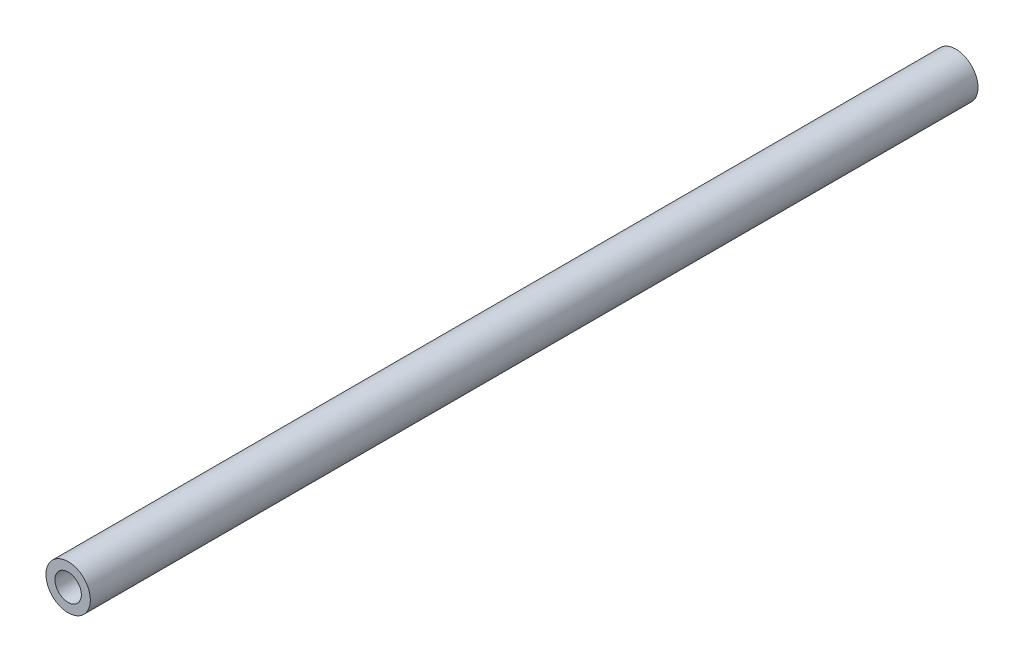
ISO-10303-21;
HEADER;
FILE_DESCRIPTION(('STEP AP214'),'2;1');
FILE_NAME('part.step','',(''),(''),'','','');
FILE_SCHEMA(('AUTOMOTIVE_DESIGN { 1 0 10303 214 1 1 1 1 }'));
ENDSEC;
DATA;
#1=APPLICATION_CONTEXT('core data for automotive mechanical design processes');
#2=APPLICATION_PROTOCOL_DEFINITION('international standard','automotive_design',2000,#1);
#3=PRODUCT_CONTEXT('',#1,'mechanical');
#4=PRODUCT('Part','Part','',(#3));
#5=PRODUCT_RELATED_PRODUCT_CATEGORY('part','',(#4));
#6=PRODUCT_DEFINITION_FORMATION('','',#4);
#7=PRODUCT_DEFINITION_CONTEXT('part definition',#1,'design');
#8=PRODUCT_DEFINITION('design','',#6,#7);
#9=PRODUCT_DEFINITION_SHAPE('','',#8);
#10=(LENGTH_UNIT() NAMED_UNIT(*) SI_UNIT(.MILLI.,.METRE.));
#11=(NAMED_UNIT(*) PLANE_ANGLE_UNIT() SI_UNIT($,.RADIAN.));
#12=(NAMED_UNIT(*) SI_UNIT($,.STERADIAN.) SOLID_ANGLE_UNIT());
#13=UNCERTAINTY_MEASURE_WITH_UNIT(LENGTH_MEASURE(1.E-05),#10,'distance_accuracy_value','');
#14=(GEOMETRIC_REPRESENTATION_CONTEXT(3) GLOBAL_UNCERTAINTY_ASSIGNED_CONTEXT((#13)) GLOBAL_UNIT_ASSIGNED_CONTEXT((#10,
#11,#12)) REPRESENTATION_CONTEXT('',''));
#15=CARTESIAN_POINT('',(0.,0.,0.));
#16=DIRECTION('',(0.,0.,1.));
#17=DIRECTION('',(1.,0.,0.));
#18=AXIS2_PLACEMENT_3D('',#15,#16,#17);
#19=CARTESIAN_POINT('',(0.,0.,320.));
#20=DIRECTION('',(0.,0.,-1.));
#21=DIRECTION('',(-1.,0.,0.));
#22=AXIS2_PLACEMENT_3D('',#19,#20,#21);
#23=CYLINDRICAL_SURFACE('',#22,8.);
#24=CARTESIAN_POINT('',(0.,0.,320.));
#25=DIRECTION('',(0.,0.,1.));
#26=DIRECTION('',(1.,0.,0.));
#27=AXIS2_PLACEMENT_3D('',#24,#25,#26);
#28=CIRCLE('',#27,8.);
#29=CARTESIAN_POINT('',(8.,0.,320.));
#30=VERTEX_POINT('',#29);
#31=EDGE_CURVE('E10',#30,#30,#28,.T.);
#32=ORIENTED_EDGE('',*,*,#31,.F.);
#33=EDGE_LOOP('',(#32));
#34=FACE_BOUND('',#33,.T.);
#35=CARTESIAN_POINT('',(0.,0.,0.));
#36=DIRECTION('',(0.,0.,1.));
#37=DIRECTION('',(1.,0.,0.));
#38=AXIS2_PLACEMENT_3D('',#35,#36,#37);
#39=CIRCLE('',#38,8.);
#40=CARTESIAN_POINT('',(8.,0.,0.));
#41=VERTEX_POINT('',#40);
#42=EDGE_CURVE('E39',#41,#41,#39,.T.);
#43=ORIENTED_EDGE('',*,*,#42,.T.);
#44=EDGE_LOOP('',(#43));
#45=FACE_BOUND('',#44,.T.);
#46=ADVANCED_FACE('F36',(#34,#45),#23,.T.);
#47=CARTESIAN_POINT('',(0.,0.,320.));
#48=DIRECTION('',(0.,0.,1.));
#49=DIRECTION('',(1.,0.,0.));
#50=AXIS2_PLACEMENT_3D('',#47,#48,#49);
#51=PLANE('',#50);
#52=CARTESIAN_POINT('',(0.,0.,320.));
#53=DIRECTION('',(0.,0.,-1.));
#54=DIRECTION('',(-1.,0.,0.));
#55=AXIS2_PLACEMENT_3D('',#52,#53,#54);
#56=CIRCLE('',#55,4.755);
#57=CARTESIAN_POINT('',(-4.755,0.,320.));
#58=VERTEX_POINT('',#57);
#59=EDGE_CURVE('E48',#58,#58,#56,.T.);
#60=ORIENTED_EDGE('',*,*,#59,.T.);
#61=EDGE_LOOP('',(#60));
#62=FACE_BOUND('',#61,.T.);
#63=ORIENTED_EDGE('',*,*,#31,.T.);
#64=EDGE_LOOP('',(#63));
#65=FACE_BOUND('',#64,.T.);
#66=ADVANCED_FACE('F58',(#62,#65),#51,.T.);
#67=CARTESIAN_POINT('',(0.,0.,0.));
#68=DIRECTION('',(0.,0.,1.));
#69=DIRECTION('',(1.,0.,0.));
#70=AXIS2_PLACEMENT_3D('',#67,#68,#69);
#71=PLANE('',#70);
#72=CARTESIAN_POINT('',(0.,0.,0.));
#73=DIRECTION('',(0.,0.,-1.));
#74=DIRECTION('',(-1.,0.,0.));
#75=AXIS2_PLACEMENT_3D('',#72,#73,#74);
#76=CIRCLE('',#75,4.755);
#77=CARTESIAN_POINT('',(-4.755,0.,0.));
#78=VERTEX_POINT('',#77);
#79=EDGE_CURVE('E50',#78,#78,#76,.T.);
#80=ORIENTED_EDGE('',*,*,#79,.F.);
#81=EDGE_LOOP('',(#80));
#82=FACE_BOUND('',#81,.T.);
#83=ORIENTED_EDGE('',*,*,#42,.F.);
#84=EDGE_LOOP('',(#83));
#85=FACE_BOUND('',#84,.T.);
#86=ADVANCED_FACE('F63',(#82,#85),#71,.F.);
#87=CARTESIAN_POINT('',(0.,0.,320.));
#88=DIRECTION('',(0.,0.,-1.));
#89=DIRECTION('',(-1.,0.,0.));
#90=AXIS2_PLACEMENT_3D('',#87,#88,#89);
#91=CYLINDRICAL_SURFACE('',#90,4.755);
#92=ORIENTED_EDGE('',*,*,#59,.F.);
#93=EDGE_LOOP('',(#92));
#94=FACE_BOUND('',#93,.T.);
#95=ORIENTED_EDGE('',*,*,#79,.T.);
#96=EDGE_LOOP('',(#95));
#97=FACE_BOUND('',#96,.T.);
#98=ADVANCED_FACE('F60',(#94,#97),#91,.F.);
#99=CLOSED_SHELL('',(#46,#66,#86,#98));
#100=MANIFOLD_SOLID_BREP('B2',#99);
#101=ADVANCED_BREP_SHAPE_REPRESENTATION('',(#18,#100),#14);
#102=SHAPE_DEFINITION_REPRESENTATION(#9,#101);
ENDSEC;
END-ISO-10303-21;
